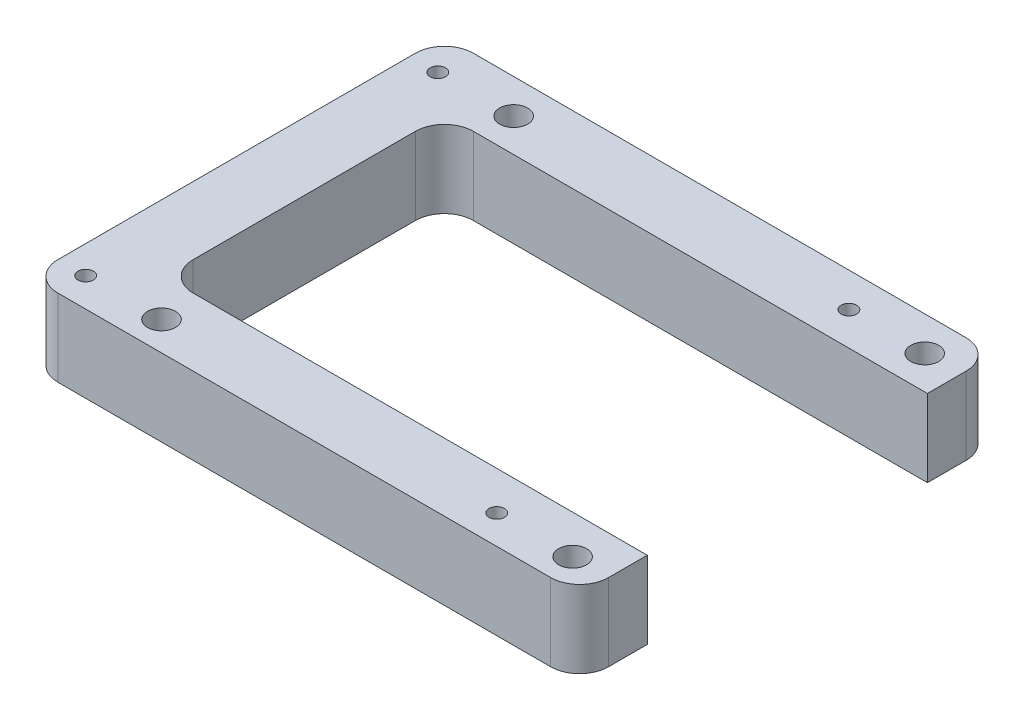
ISO-10303-21;
HEADER;
FILE_DESCRIPTION(('STEP AP214'),'2;1');
FILE_NAME('part.step','',(''),(''),'','','');
FILE_SCHEMA(('AUTOMOTIVE_DESIGN { 1 0 10303 214 1 1 1 1 }'));
ENDSEC;
DATA;
#1=APPLICATION_CONTEXT('core data for automotive mechanical design processes');
#2=APPLICATION_PROTOCOL_DEFINITION('international standard','automotive_design',2000,#1);
#3=PRODUCT_CONTEXT('',#1,'mechanical');
#4=PRODUCT('Part','Part','',(#3));
#5=PRODUCT_RELATED_PRODUCT_CATEGORY('part','',(#4));
#6=PRODUCT_DEFINITION_FORMATION('','',#4);
#7=PRODUCT_DEFINITION_CONTEXT('part definition',#1,'design');
#8=PRODUCT_DEFINITION('design','',#6,#7);
#9=PRODUCT_DEFINITION_SHAPE('','',#8);
#10=(LENGTH_UNIT() NAMED_UNIT(*) SI_UNIT(.MILLI.,.METRE.));
#11=(NAMED_UNIT(*) PLANE_ANGLE_UNIT() SI_UNIT($,.RADIAN.));
#12=(NAMED_UNIT(*) SI_UNIT($,.STERADIAN.) SOLID_ANGLE_UNIT());
#13=UNCERTAINTY_MEASURE_WITH_UNIT(LENGTH_MEASURE(1.E-05),#10,'distance_accuracy_value','');
#14=(GEOMETRIC_REPRESENTATION_CONTEXT(3) GLOBAL_UNCERTAINTY_ASSIGNED_CONTEXT((#13)) GLOBAL_UNIT_ASSIGNED_CONTEXT((#10,
#11,#12)) REPRESENTATION_CONTEXT('',''));
#15=CARTESIAN_POINT('',(0.,0.,0.));
#16=DIRECTION('',(0.,0.,1.));
#17=DIRECTION('',(1.,0.,0.));
#18=AXIS2_PLACEMENT_3D('',#15,#16,#17);
#19=CARTESIAN_POINT('',(28.5,8.,-21.5));
#20=DIRECTION('',(1.,0.,0.));
#21=DIRECTION('',(0.,0.,-1.));
#22=AXIS2_PLACEMENT_3D('',#19,#20,#21);
#23=PLANE('',#22);
#24=DIRECTION('',(0.,0.,1.));
#25=VECTOR('',#24,1.);
#26=CARTESIAN_POINT('',(28.5,0.,-21.5));
#27=LINE('',#26,#25);
#28=CARTESIAN_POINT('',(28.5,0.,-18.5));
#29=VERTEX_POINT('',#28);
#30=CARTESIAN_POINT('',(28.5,0.,-14.5));
#31=VERTEX_POINT('',#30);
#32=EDGE_CURVE('E200',#29,#31,#27,.T.);
#33=ORIENTED_EDGE('',*,*,#32,.F.);
#34=DIRECTION('',(0.,-1.,0.));
#35=VECTOR('',#34,1.);
#36=CARTESIAN_POINT('',(28.5,8.,-18.5));
#37=LINE('',#36,#35);
#38=CARTESIAN_POINT('',(28.5,8.,-18.5));
#39=VERTEX_POINT('',#38);
#40=EDGE_CURVE('E148',#29,#39,#37,.F.);
#41=ORIENTED_EDGE('',*,*,#40,.T.);
#42=DIRECTION('',(0.,0.,1.));
#43=VECTOR('',#42,1.);
#44=CARTESIAN_POINT('',(28.5,8.,-21.5));
#45=LINE('',#44,#43);
#46=CARTESIAN_POINT('',(28.5,8.,-14.5));
#47=VERTEX_POINT('',#46);
#48=EDGE_CURVE('E143',#39,#47,#45,.T.);
#49=ORIENTED_EDGE('',*,*,#48,.T.);
#50=DIRECTION('',(0.,-1.,0.));
#51=VECTOR('',#50,1.);
#52=CARTESIAN_POINT('',(28.5,8.,-14.5));
#53=LINE('',#52,#51);
#54=EDGE_CURVE('E146',#47,#31,#53,.T.);
#55=ORIENTED_EDGE('',*,*,#54,.T.);
#56=EDGE_LOOP('',(#33,#41,#49,#55));
#57=FACE_BOUND('',#56,.T.);
#58=ADVANCED_FACE('F40',(#57),#23,.T.);
#59=CARTESIAN_POINT('',(28.5,8.,14.5));
#60=VERTEX_POINT('',#59);
#61=CARTESIAN_POINT('',(28.5,8.,18.5));
#62=VERTEX_POINT('',#61);
#63=EDGE_CURVE('E152',#60,#62,#45,.T.);
#64=ORIENTED_EDGE('',*,*,#63,.T.);
#65=DIRECTION('',(0.,-1.,0.));
#66=VECTOR('',#65,1.);
#67=CARTESIAN_POINT('',(28.5,0.,18.5));
#68=LINE('',#67,#66);
#69=CARTESIAN_POINT('',(28.5,0.,18.5));
#70=VERTEX_POINT('',#69);
#71=EDGE_CURVE('E244',#62,#70,#68,.T.);
#72=ORIENTED_EDGE('',*,*,#71,.T.);
#73=CARTESIAN_POINT('',(28.5,0.,14.5));
#74=VERTEX_POINT('',#73);
#75=EDGE_CURVE('E199',#74,#70,#27,.T.);
#76=ORIENTED_EDGE('',*,*,#75,.F.);
#77=DIRECTION('',(0.,-1.,0.));
#78=VECTOR('',#77,1.);
#79=CARTESIAN_POINT('',(28.5,8.,14.5));
#80=LINE('',#79,#78);
#81=EDGE_CURVE('E164',#60,#74,#80,.T.);
#82=ORIENTED_EDGE('',*,*,#81,.F.);
#83=EDGE_LOOP('',(#64,#72,#76,#82));
#84=FACE_BOUND('',#83,.T.);
#85=ADVANCED_FACE('F275',(#84),#23,.T.);
#86=CARTESIAN_POINT('',(0.,8.,0.));
#87=DIRECTION('',(0.,-1.,0.));
#88=DIRECTION('',(0.,0.,-1.));
#89=AXIS2_PLACEMENT_3D('',#86,#87,#88);
#90=PLANE('',#89);
#91=CARTESIAN_POINT('',(24.77,8.,-17.95));
#92=DIRECTION('',(0.,-1.,0.));
#93=DIRECTION('',(0.,0.,-1.));
#94=AXIS2_PLACEMENT_3D('',#91,#92,#93);
#95=CIRCLE('',#94,1.45);
#96=CARTESIAN_POINT('',(24.77,8.,-19.4));
#97=VERTEX_POINT('',#96);
#98=EDGE_CURVE('E336',#97,#97,#95,.T.);
#99=ORIENTED_EDGE('',*,*,#98,.T.);
#100=EDGE_LOOP('',(#99));
#101=FACE_BOUND('',#100,.T.);
#102=CARTESIAN_POINT('',(-17.78,8.,-17.95));
#103=DIRECTION('',(0.,-1.,0.));
#104=DIRECTION('',(0.,0.,-1.));
#105=AXIS2_PLACEMENT_3D('',#102,#103,#104);
#106=CIRCLE('',#105,1.45);
#107=CARTESIAN_POINT('',(-17.78,8.,-19.4));
#108=VERTEX_POINT('',#107);
#109=EDGE_CURVE('E340',#108,#108,#106,.T.);
#110=ORIENTED_EDGE('',*,*,#109,.T.);
#111=EDGE_LOOP('',(#110));
#112=FACE_BOUND('',#111,.T.);
#113=CARTESIAN_POINT('',(-17.78,8.,18.5));
#114=DIRECTION('',(0.,-1.,0.));
#115=DIRECTION('',(0.,0.,-1.));
#116=AXIS2_PLACEMENT_3D('',#113,#114,#115);
#117=CIRCLE('',#116,1.45);
#118=CARTESIAN_POINT('',(-17.78,8.,17.05));
#119=VERTEX_POINT('',#118);
#120=EDGE_CURVE('E344',#119,#119,#117,.T.);
#121=ORIENTED_EDGE('',*,*,#120,.T.);
#122=EDGE_LOOP('',(#121));
#123=FACE_BOUND('',#122,.T.);
#124=CARTESIAN_POINT('',(24.77,8.,18.5));
#125=DIRECTION('',(0.,-1.,0.));
#126=DIRECTION('',(0.,0.,-1.));
#127=AXIS2_PLACEMENT_3D('',#124,#125,#126);
#128=CIRCLE('',#127,1.45);
#129=CARTESIAN_POINT('',(24.77,8.,17.05));
#130=VERTEX_POINT('',#129);
#131=EDGE_CURVE('E348',#130,#130,#128,.T.);
#132=ORIENTED_EDGE('',*,*,#131,.T.);
#133=EDGE_LOOP('',(#132));
#134=FACE_BOUND('',#133,.T.);
#135=CARTESIAN_POINT('',(-25.63,8.,-17.95));
#136=DIRECTION('',(0.,-1.,0.));
#137=DIRECTION('',(0.,0.,-1.));
#138=AXIS2_PLACEMENT_3D('',#135,#136,#137);
#139=CIRCLE('',#138,0.799999999999999);
#140=CARTESIAN_POINT('',(-25.63,8.,-18.75));
#141=VERTEX_POINT('',#140);
#142=EDGE_CURVE('E352',#141,#141,#139,.T.);
#143=ORIENTED_EDGE('',*,*,#142,.T.);
#144=EDGE_LOOP('',(#143));
#145=FACE_BOUND('',#144,.T.);
#146=CARTESIAN_POINT('',(-25.63,8.,18.5));
#147=DIRECTION('',(0.,-1.,0.));
#148=DIRECTION('',(0.,0.,-1.));
#149=AXIS2_PLACEMENT_3D('',#146,#147,#148);
#150=CIRCLE('',#149,0.799999999999999);
#151=CARTESIAN_POINT('',(-25.63,8.,17.7));
#152=VERTEX_POINT('',#151);
#153=EDGE_CURVE('E356',#152,#152,#150,.T.);
#154=ORIENTED_EDGE('',*,*,#153,.T.);
#155=EDGE_LOOP('',(#154));
#156=FACE_BOUND('',#155,.T.);
#157=CARTESIAN_POINT('',(16.92,8.,18.5));
#158=DIRECTION('',(0.,-1.,0.));
#159=DIRECTION('',(0.,0.,-1.));
#160=AXIS2_PLACEMENT_3D('',#157,#158,#159);
#161=CIRCLE('',#160,0.799999999999999);
#162=CARTESIAN_POINT('',(16.92,8.,17.7));
#163=VERTEX_POINT('',#162);
#164=EDGE_CURVE('E360',#163,#163,#161,.T.);
#165=ORIENTED_EDGE('',*,*,#164,.T.);
#166=EDGE_LOOP('',(#165));
#167=FACE_BOUND('',#166,.T.);
#168=CARTESIAN_POINT('',(16.92,8.,-17.95));
#169=DIRECTION('',(0.,-1.,0.));
#170=DIRECTION('',(0.,0.,-1.));
#171=AXIS2_PLACEMENT_3D('',#168,#169,#170);
#172=CIRCLE('',#171,0.799999999999999);
#173=CARTESIAN_POINT('',(16.92,8.,-18.75));
#174=VERTEX_POINT('',#173);
#175=EDGE_CURVE('E179',#174,#174,#172,.T.);
#176=ORIENTED_EDGE('',*,*,#175,.T.);
#177=EDGE_LOOP('',(#176));
#178=FACE_BOUND('',#177,.T.);
#179=DIRECTION('',(1.,0.,0.));
#180=VECTOR('',#179,1.);
#181=CARTESIAN_POINT('',(-28.5,8.,-21.5));
#182=LINE('',#181,#180);
#183=CARTESIAN_POINT('',(-25.5,8.,-21.5));
#184=VERTEX_POINT('',#183);
#185=CARTESIAN_POINT('',(25.5,8.,-21.5));
#186=VERTEX_POINT('',#185);
#187=EDGE_CURVE('E188',#184,#186,#182,.T.);
#188=ORIENTED_EDGE('',*,*,#187,.F.);
#189=CARTESIAN_POINT('',(-25.5,8.,-18.5));
#190=DIRECTION('',(0.,-1.,0.));
#191=DIRECTION('',(0.,0.,-1.));
#192=AXIS2_PLACEMENT_3D('',#189,#190,#191);
#193=CIRCLE('',#192,3.);
#194=CARTESIAN_POINT('',(-28.5,8.,-18.5));
#195=VERTEX_POINT('',#194);
#196=EDGE_CURVE('E237',#184,#195,#193,.F.);
#197=ORIENTED_EDGE('',*,*,#196,.T.);
#198=DIRECTION('',(0.,0.,1.));
#199=VECTOR('',#198,1.);
#200=CARTESIAN_POINT('',(-28.5,8.,-21.5));
#201=LINE('',#200,#199);
#202=CARTESIAN_POINT('',(-28.5,8.,18.5));
#203=VERTEX_POINT('',#202);
#204=EDGE_CURVE('E193',#195,#203,#201,.T.);
#205=ORIENTED_EDGE('',*,*,#204,.T.);
#206=CARTESIAN_POINT('',(-25.5,8.,18.5));
#207=DIRECTION('',(0.,-1.,0.));
#208=DIRECTION('',(0.,0.,-1.));
#209=AXIS2_PLACEMENT_3D('',#206,#207,#208);
#210=CIRCLE('',#209,3.);
#211=CARTESIAN_POINT('',(-25.5,8.,21.5));
#212=VERTEX_POINT('',#211);
#213=EDGE_CURVE('E235',#203,#212,#210,.F.);
#214=ORIENTED_EDGE('',*,*,#213,.T.);
#215=DIRECTION('',(1.,0.,0.));
#216=VECTOR('',#215,1.);
#217=CARTESIAN_POINT('',(-28.5,8.,21.5));
#218=LINE('',#217,#216);
#219=CARTESIAN_POINT('',(25.5,8.,21.5));
#220=VERTEX_POINT('',#219);
#221=EDGE_CURVE('E151',#212,#220,#218,.T.);
#222=ORIENTED_EDGE('',*,*,#221,.T.);
#223=CARTESIAN_POINT('',(25.5,8.,18.5));
#224=DIRECTION('',(0.,-1.,0.));
#225=DIRECTION('',(0.,0.,-1.));
#226=AXIS2_PLACEMENT_3D('',#223,#224,#225);
#227=CIRCLE('',#226,3.);
#228=EDGE_CURVE('E55',#220,#62,#227,.F.);
#229=ORIENTED_EDGE('',*,*,#228,.T.);
#230=ORIENTED_EDGE('',*,*,#63,.F.);
#231=DIRECTION('',(1.,0.,0.));
#232=VECTOR('',#231,1.);
#233=CARTESIAN_POINT('',(28.5,8.,14.5));
#234=LINE('',#233,#232);
#235=CARTESIAN_POINT('',(-18.5,8.,14.5));
#236=VERTEX_POINT('',#235);
#237=EDGE_CURVE('E174',#236,#60,#234,.T.);
#238=ORIENTED_EDGE('',*,*,#237,.F.);
#239=CARTESIAN_POINT('',(-18.5,8.,11.5));
#240=DIRECTION('',(0.,-1.,0.));
#241=DIRECTION('',(0.,0.,-1.));
#242=AXIS2_PLACEMENT_3D('',#239,#240,#241);
#243=CIRCLE('',#242,3.);
#244=CARTESIAN_POINT('',(-21.5,8.,11.5));
#245=VERTEX_POINT('',#244);
#246=EDGE_CURVE('E249',#236,#245,#243,.T.);
#247=ORIENTED_EDGE('',*,*,#246,.T.);
#248=DIRECTION('',(0.,0.,1.));
#249=VECTOR('',#248,1.);
#250=CARTESIAN_POINT('',(-21.5,8.,14.5));
#251=LINE('',#250,#249);
#252=CARTESIAN_POINT('',(-21.5,8.,-11.5));
#253=VERTEX_POINT('',#252);
#254=EDGE_CURVE('E170',#253,#245,#251,.T.);
#255=ORIENTED_EDGE('',*,*,#254,.F.);
#256=CARTESIAN_POINT('',(-18.5,8.,-11.5));
#257=DIRECTION('',(0.,-1.,0.));
#258=DIRECTION('',(0.,0.,-1.));
#259=AXIS2_PLACEMENT_3D('',#256,#257,#258);
#260=CIRCLE('',#259,3.);
#261=CARTESIAN_POINT('',(-18.5,8.,-14.5));
#262=VERTEX_POINT('',#261);
#263=EDGE_CURVE('E11',#253,#262,#260,.T.);
#264=ORIENTED_EDGE('',*,*,#263,.T.);
#265=DIRECTION('',(-1.,0.,0.));
#266=VECTOR('',#265,1.);
#267=CARTESIAN_POINT('',(28.5,8.,-14.5));
#268=LINE('',#267,#266);
#269=EDGE_CURVE('E159',#47,#262,#268,.T.);
#270=ORIENTED_EDGE('',*,*,#269,.F.);
#271=ORIENTED_EDGE('',*,*,#48,.F.);
#272=CARTESIAN_POINT('',(25.5,8.,-18.5));
#273=DIRECTION('',(0.,-1.,0.));
#274=DIRECTION('',(0.,0.,-1.));
#275=AXIS2_PLACEMENT_3D('',#272,#273,#274);
#276=CIRCLE('',#275,3.);
#277=EDGE_CURVE('E233',#39,#186,#276,.F.);
#278=ORIENTED_EDGE('',*,*,#277,.T.);
#279=EDGE_LOOP('',(#188,#197,#205,#214,#222,#229,#230,#238,#247,#255,#264,#270,#271,#278));
#280=FACE_BOUND('',#279,.T.);
#281=ADVANCED_FACE('F167',(#101,#112,#123,#134,#145,#156,#167,#178,#280),#90,.F.);
#282=CARTESIAN_POINT('',(0.,0.,0.));
#283=DIRECTION('',(0.,-1.,0.));
#284=DIRECTION('',(0.,0.,-1.));
#285=AXIS2_PLACEMENT_3D('',#282,#283,#284);
#286=PLANE('',#285);
#287=CARTESIAN_POINT('',(24.77,0.,-17.95));
#288=DIRECTION('',(0.,-1.,0.));
#289=DIRECTION('',(0.,0.,-1.));
#290=AXIS2_PLACEMENT_3D('',#287,#288,#289);
#291=CIRCLE('',#290,2.45);
#292=CARTESIAN_POINT('',(24.77,0.,-20.4));
#293=VERTEX_POINT('',#292);
#294=EDGE_CURVE('E418',#293,#293,#291,.T.);
#295=ORIENTED_EDGE('',*,*,#294,.F.);
#296=EDGE_LOOP('',(#295));
#297=FACE_BOUND('',#296,.T.);
#298=CARTESIAN_POINT('',(-17.78,0.,-17.95));
#299=DIRECTION('',(0.,-1.,0.));
#300=DIRECTION('',(0.,0.,-1.));
#301=AXIS2_PLACEMENT_3D('',#298,#299,#300);
#302=CIRCLE('',#301,2.45);
#303=CARTESIAN_POINT('',(-17.78,0.,-20.4));
#304=VERTEX_POINT('',#303);
#305=EDGE_CURVE('E408',#304,#304,#302,.T.);
#306=ORIENTED_EDGE('',*,*,#305,.F.);
#307=EDGE_LOOP('',(#306));
#308=FACE_BOUND('',#307,.T.);
#309=CARTESIAN_POINT('',(-17.78,0.,18.5));
#310=DIRECTION('',(0.,-1.,0.));
#311=DIRECTION('',(0.,0.,-1.));
#312=AXIS2_PLACEMENT_3D('',#309,#310,#311);
#313=CIRCLE('',#312,2.45);
#314=CARTESIAN_POINT('',(-17.78,0.,16.05));
#315=VERTEX_POINT('',#314);
#316=EDGE_CURVE('E398',#315,#315,#313,.T.);
#317=ORIENTED_EDGE('',*,*,#316,.F.);
#318=EDGE_LOOP('',(#317));
#319=FACE_BOUND('',#318,.T.);
#320=CARTESIAN_POINT('',(24.77,0.,18.5));
#321=DIRECTION('',(0.,-1.,0.));
#322=DIRECTION('',(0.,0.,-1.));
#323=AXIS2_PLACEMENT_3D('',#320,#321,#322);
#324=CIRCLE('',#323,2.45);
#325=CARTESIAN_POINT('',(24.77,0.,16.05));
#326=VERTEX_POINT('',#325);
#327=EDGE_CURVE('E388',#326,#326,#324,.T.);
#328=ORIENTED_EDGE('',*,*,#327,.F.);
#329=EDGE_LOOP('',(#328));
#330=FACE_BOUND('',#329,.T.);
#331=CARTESIAN_POINT('',(-25.63,0.,-17.95));
#332=DIRECTION('',(0.,-1.,0.));
#333=DIRECTION('',(0.,0.,-1.));
#334=AXIS2_PLACEMENT_3D('',#331,#332,#333);
#335=CIRCLE('',#334,0.799999999999999);
#336=CARTESIAN_POINT('',(-25.63,0.,-18.75));
#337=VERTEX_POINT('',#336);
#338=EDGE_CURVE('E378',#337,#337,#335,.T.);
#339=ORIENTED_EDGE('',*,*,#338,.F.);
#340=EDGE_LOOP('',(#339));
#341=FACE_BOUND('',#340,.T.);
#342=CARTESIAN_POINT('',(-25.63,0.,18.5));
#343=DIRECTION('',(0.,-1.,0.));
#344=DIRECTION('',(0.,0.,-1.));
#345=AXIS2_PLACEMENT_3D('',#342,#343,#344);
#346=CIRCLE('',#345,0.799999999999999);
#347=CARTESIAN_POINT('',(-25.63,0.,17.7));
#348=VERTEX_POINT('',#347);
#349=EDGE_CURVE('E374',#348,#348,#346,.T.);
#350=ORIENTED_EDGE('',*,*,#349,.F.);
#351=EDGE_LOOP('',(#350));
#352=FACE_BOUND('',#351,.T.);
#353=CARTESIAN_POINT('',(16.92,0.,18.5));
#354=DIRECTION('',(0.,-1.,0.));
#355=DIRECTION('',(0.,0.,-1.));
#356=AXIS2_PLACEMENT_3D('',#353,#354,#355);
#357=CIRCLE('',#356,0.799999999999999);
#358=CARTESIAN_POINT('',(16.92,0.,17.7));
#359=VERTEX_POINT('',#358);
#360=EDGE_CURVE('E368',#359,#359,#357,.T.);
#361=ORIENTED_EDGE('',*,*,#360,.F.);
#362=EDGE_LOOP('',(#361));
#363=FACE_BOUND('',#362,.T.);
#364=CARTESIAN_POINT('',(16.92,0.,-17.95));
#365=DIRECTION('',(0.,-1.,0.));
#366=DIRECTION('',(0.,0.,-1.));
#367=AXIS2_PLACEMENT_3D('',#364,#365,#366);
#368=CIRCLE('',#367,0.799999999999999);
#369=CARTESIAN_POINT('',(16.92,0.,-18.75));
#370=VERTEX_POINT('',#369);
#371=EDGE_CURVE('E364',#370,#370,#368,.T.);
#372=ORIENTED_EDGE('',*,*,#371,.F.);
#373=EDGE_LOOP('',(#372));
#374=FACE_BOUND('',#373,.T.);
#375=DIRECTION('',(0.,0.,1.));
#376=VECTOR('',#375,1.);
#377=CARTESIAN_POINT('',(-28.5,0.,-21.5));
#378=LINE('',#377,#376);
#379=CARTESIAN_POINT('',(-28.5,0.,-18.5));
#380=VERTEX_POINT('',#379);
#381=CARTESIAN_POINT('',(-28.5,0.,18.5));
#382=VERTEX_POINT('',#381);
#383=EDGE_CURVE('E190',#380,#382,#378,.T.);
#384=ORIENTED_EDGE('',*,*,#383,.F.);
#385=CARTESIAN_POINT('',(-25.5,0.,-18.5));
#386=DIRECTION('',(0.,-1.,0.));
#387=DIRECTION('',(0.,0.,-1.));
#388=AXIS2_PLACEMENT_3D('',#385,#386,#387);
#389=CIRCLE('',#388,3.);
#390=CARTESIAN_POINT('',(-25.5,0.,-21.5));
#391=VERTEX_POINT('',#390);
#392=EDGE_CURVE('E225',#380,#391,#389,.T.);
#393=ORIENTED_EDGE('',*,*,#392,.T.);
#394=DIRECTION('',(1.,0.,0.));
#395=VECTOR('',#394,1.);
#396=CARTESIAN_POINT('',(-28.5,0.,-21.5));
#397=LINE('',#396,#395);
#398=CARTESIAN_POINT('',(25.5,0.,-21.5));
#399=VERTEX_POINT('',#398);
#400=EDGE_CURVE('E163',#391,#399,#397,.T.);
#401=ORIENTED_EDGE('',*,*,#400,.T.);
#402=CARTESIAN_POINT('',(25.5,0.,-18.5));
#403=DIRECTION('',(0.,-1.,0.));
#404=DIRECTION('',(0.,0.,-1.));
#405=AXIS2_PLACEMENT_3D('',#402,#403,#404);
#406=CIRCLE('',#405,3.);
#407=EDGE_CURVE('E221',#399,#29,#406,.T.);
#408=ORIENTED_EDGE('',*,*,#407,.T.);
#409=ORIENTED_EDGE('',*,*,#32,.T.);
#410=DIRECTION('',(-1.,0.,0.));
#411=VECTOR('',#410,1.);
#412=CARTESIAN_POINT('',(28.5,0.,-14.5));
#413=LINE('',#412,#411);
#414=CARTESIAN_POINT('',(-18.5,0.,-14.5));
#415=VERTEX_POINT('',#414);
#416=EDGE_CURVE('E162',#31,#415,#413,.T.);
#417=ORIENTED_EDGE('',*,*,#416,.T.);
#418=CARTESIAN_POINT('',(-18.5,0.,-11.5));
#419=DIRECTION('',(0.,-1.,0.));
#420=DIRECTION('',(0.,0.,-1.));
#421=AXIS2_PLACEMENT_3D('',#418,#419,#420);
#422=CIRCLE('',#421,3.);
#423=CARTESIAN_POINT('',(-21.5,0.,-11.5));
#424=VERTEX_POINT('',#423);
#425=EDGE_CURVE('E48',#415,#424,#422,.F.);
#426=ORIENTED_EDGE('',*,*,#425,.T.);
#427=DIRECTION('',(0.,0.,1.));
#428=VECTOR('',#427,1.);
#429=CARTESIAN_POINT('',(-21.5,0.,14.5));
#430=LINE('',#429,#428);
#431=CARTESIAN_POINT('',(-21.5,0.,11.5));
#432=VERTEX_POINT('',#431);
#433=EDGE_CURVE('E176',#424,#432,#430,.T.);
#434=ORIENTED_EDGE('',*,*,#433,.T.);
#435=CARTESIAN_POINT('',(-18.5,0.,11.5));
#436=DIRECTION('',(0.,-1.,0.));
#437=DIRECTION('',(0.,0.,-1.));
#438=AXIS2_PLACEMENT_3D('',#435,#436,#437);
#439=CIRCLE('',#438,3.);
#440=CARTESIAN_POINT('',(-18.5,0.,14.5));
#441=VERTEX_POINT('',#440);
#442=EDGE_CURVE('E247',#432,#441,#439,.F.);
#443=ORIENTED_EDGE('',*,*,#442,.T.);
#444=DIRECTION('',(1.,0.,0.));
#445=VECTOR('',#444,1.);
#446=CARTESIAN_POINT('',(28.5,0.,14.5));
#447=LINE('',#446,#445);
#448=EDGE_CURVE('E171',#441,#74,#447,.T.);
#449=ORIENTED_EDGE('',*,*,#448,.T.);
#450=ORIENTED_EDGE('',*,*,#75,.T.);
#451=CARTESIAN_POINT('',(25.5,0.,18.5));
#452=DIRECTION('',(0.,-1.,0.));
#453=DIRECTION('',(0.,0.,-1.));
#454=AXIS2_PLACEMENT_3D('',#451,#452,#453);
#455=CIRCLE('',#454,3.);
#456=CARTESIAN_POINT('',(25.5,0.,21.5));
#457=VERTEX_POINT('',#456);
#458=EDGE_CURVE('E219',#70,#457,#455,.T.);
#459=ORIENTED_EDGE('',*,*,#458,.T.);
#460=DIRECTION('',(1.,0.,0.));
#461=VECTOR('',#460,1.);
#462=CARTESIAN_POINT('',(-28.5,0.,21.5));
#463=LINE('',#462,#461);
#464=CARTESIAN_POINT('',(-25.5,0.,21.5));
#465=VERTEX_POINT('',#464);
#466=EDGE_CURVE('E202',#465,#457,#463,.T.);
#467=ORIENTED_EDGE('',*,*,#466,.F.);
#468=CARTESIAN_POINT('',(-25.5,0.,18.5));
#469=DIRECTION('',(0.,-1.,0.));
#470=DIRECTION('',(0.,0.,-1.));
#471=AXIS2_PLACEMENT_3D('',#468,#469,#470);
#472=CIRCLE('',#471,3.);
#473=EDGE_CURVE('E223',#465,#382,#472,.T.);
#474=ORIENTED_EDGE('',*,*,#473,.T.);
#475=EDGE_LOOP('',(#384,#393,#401,#408,#409,#417,#426,#434,#443,#449,#450,#459,#467,#474));
#476=FACE_BOUND('',#475,.T.);
#477=ADVANCED_FACE('F253',(#297,#308,#319,#330,#341,#352,#363,#374,#476),#286,.T.);
#478=CARTESIAN_POINT('',(-28.5,8.,-21.5));
#479=DIRECTION('',(0.,0.,-1.));
#480=DIRECTION('',(-1.,0.,0.));
#481=AXIS2_PLACEMENT_3D('',#478,#479,#480);
#482=PLANE('',#481);
#483=ORIENTED_EDGE('',*,*,#400,.F.);
#484=DIRECTION('',(0.,-1.,0.));
#485=VECTOR('',#484,1.);
#486=CARTESIAN_POINT('',(-25.5,8.,-21.5));
#487=LINE('',#486,#485);
#488=EDGE_CURVE('E230',#391,#184,#487,.F.);
#489=ORIENTED_EDGE('',*,*,#488,.T.);
#490=ORIENTED_EDGE('',*,*,#187,.T.);
#491=DIRECTION('',(0.,-1.,0.));
#492=VECTOR('',#491,1.);
#493=CARTESIAN_POINT('',(25.5,8.,-21.5));
#494=LINE('',#493,#492);
#495=EDGE_CURVE('E227',#186,#399,#494,.T.);
#496=ORIENTED_EDGE('',*,*,#495,.T.);
#497=EDGE_LOOP('',(#483,#489,#490,#496));
#498=FACE_BOUND('',#497,.T.);
#499=ADVANCED_FACE('F285',(#498),#482,.T.);
#500=CARTESIAN_POINT('',(-28.5,8.,-21.5));
#501=DIRECTION('',(1.,0.,0.));
#502=DIRECTION('',(0.,0.,-1.));
#503=AXIS2_PLACEMENT_3D('',#500,#501,#502);
#504=PLANE('',#503);
#505=ORIENTED_EDGE('',*,*,#204,.F.);
#506=DIRECTION('',(0.,-1.,0.));
#507=VECTOR('',#506,1.);
#508=CARTESIAN_POINT('',(-28.5,0.,-18.5));
#509=LINE('',#508,#507);
#510=EDGE_CURVE('E216',#195,#380,#509,.T.);
#511=ORIENTED_EDGE('',*,*,#510,.T.);
#512=ORIENTED_EDGE('',*,*,#383,.T.);
#513=DIRECTION('',(0.,-1.,0.));
#514=VECTOR('',#513,1.);
#515=CARTESIAN_POINT('',(-28.5,8.,18.5));
#516=LINE('',#515,#514);
#517=EDGE_CURVE('E214',#382,#203,#516,.F.);
#518=ORIENTED_EDGE('',*,*,#517,.T.);
#519=EDGE_LOOP('',(#505,#511,#512,#518));
#520=FACE_BOUND('',#519,.T.);
#521=ADVANCED_FACE('F287',(#520),#504,.F.);
#522=CARTESIAN_POINT('',(-28.5,8.,21.5));
#523=DIRECTION('',(0.,0.,-1.));
#524=DIRECTION('',(-1.,0.,0.));
#525=AXIS2_PLACEMENT_3D('',#522,#523,#524);
#526=PLANE('',#525);
#527=ORIENTED_EDGE('',*,*,#221,.F.);
#528=DIRECTION('',(0.,-1.,0.));
#529=VECTOR('',#528,1.);
#530=CARTESIAN_POINT('',(-25.5,8.,21.5));
#531=LINE('',#530,#529);
#532=EDGE_CURVE('E240',#212,#465,#531,.T.);
#533=ORIENTED_EDGE('',*,*,#532,.T.);
#534=ORIENTED_EDGE('',*,*,#466,.T.);
#535=DIRECTION('',(0.,-1.,0.));
#536=VECTOR('',#535,1.);
#537=CARTESIAN_POINT('',(25.5,8.,21.5));
#538=LINE('',#537,#536);
#539=EDGE_CURVE('E63',#457,#220,#538,.F.);
#540=ORIENTED_EDGE('',*,*,#539,.T.);
#541=EDGE_LOOP('',(#527,#533,#534,#540));
#542=FACE_BOUND('',#541,.T.);
#543=ADVANCED_FACE('F283',(#542),#526,.F.);
#544=CARTESIAN_POINT('',(28.5,8.,-14.5));
#545=DIRECTION('',(0.,0.,1.));
#546=DIRECTION('',(1.,0.,0.));
#547=AXIS2_PLACEMENT_3D('',#544,#545,#546);
#548=PLANE('',#547);
#549=ORIENTED_EDGE('',*,*,#269,.T.);
#550=DIRECTION('',(0.,-1.,0.));
#551=VECTOR('',#550,1.);
#552=CARTESIAN_POINT('',(-18.5,0.,-14.5));
#553=LINE('',#552,#551);
#554=EDGE_CURVE('E212',#262,#415,#553,.T.);
#555=ORIENTED_EDGE('',*,*,#554,.T.);
#556=ORIENTED_EDGE('',*,*,#416,.F.);
#557=ORIENTED_EDGE('',*,*,#54,.F.);
#558=EDGE_LOOP('',(#549,#555,#556,#557));
#559=FACE_BOUND('',#558,.T.);
#560=ADVANCED_FACE('F157',(#559),#548,.T.);
#561=CARTESIAN_POINT('',(-21.5,8.,14.5));
#562=DIRECTION('',(1.,0.,0.));
#563=DIRECTION('',(0.,0.,-1.));
#564=AXIS2_PLACEMENT_3D('',#561,#562,#563);
#565=PLANE('',#564);
#566=ORIENTED_EDGE('',*,*,#254,.T.);
#567=DIRECTION('',(0.,-1.,0.));
#568=VECTOR('',#567,1.);
#569=CARTESIAN_POINT('',(-21.5,0.,11.5));
#570=LINE('',#569,#568);
#571=EDGE_CURVE('E207',#245,#432,#570,.T.);
#572=ORIENTED_EDGE('',*,*,#571,.T.);
#573=ORIENTED_EDGE('',*,*,#433,.F.);
#574=DIRECTION('',(0.,-1.,0.));
#575=VECTOR('',#574,1.);
#576=CARTESIAN_POINT('',(-21.5,8.,-11.5));
#577=LINE('',#576,#575);
#578=EDGE_CURVE('E196',#424,#253,#577,.F.);
#579=ORIENTED_EDGE('',*,*,#578,.T.);
#580=EDGE_LOOP('',(#566,#572,#573,#579));
#581=FACE_BOUND('',#580,.T.);
#582=ADVANCED_FACE('F257',(#581),#565,.T.);
#583=CARTESIAN_POINT('',(28.5,8.,14.5));
#584=DIRECTION('',(0.,0.,-1.));
#585=DIRECTION('',(-1.,0.,0.));
#586=AXIS2_PLACEMENT_3D('',#583,#584,#585);
#587=PLANE('',#586);
#588=ORIENTED_EDGE('',*,*,#448,.F.);
#589=DIRECTION('',(0.,-1.,0.));
#590=VECTOR('',#589,1.);
#591=CARTESIAN_POINT('',(-18.5,8.,14.5));
#592=LINE('',#591,#590);
#593=EDGE_CURVE('E210',#441,#236,#592,.F.);
#594=ORIENTED_EDGE('',*,*,#593,.T.);
#595=ORIENTED_EDGE('',*,*,#237,.T.);
#596=ORIENTED_EDGE('',*,*,#81,.T.);
#597=EDGE_LOOP('',(#588,#594,#595,#596));
#598=FACE_BOUND('',#597,.T.);
#599=ADVANCED_FACE('F271',(#598),#587,.T.);
#600=CARTESIAN_POINT('',(-18.5,8.,11.5));
#601=DIRECTION('',(0.,1.,0.));
#602=DIRECTION('',(0.,0.,1.));
#603=AXIS2_PLACEMENT_3D('',#600,#601,#602);
#604=CYLINDRICAL_SURFACE('',#603,3.);
#605=ORIENTED_EDGE('',*,*,#246,.F.);
#606=ORIENTED_EDGE('',*,*,#593,.F.);
#607=ORIENTED_EDGE('',*,*,#442,.F.);
#608=ORIENTED_EDGE('',*,*,#571,.F.);
#609=EDGE_LOOP('',(#605,#606,#607,#608));
#610=FACE_BOUND('',#609,.T.);
#611=ADVANCED_FACE('F262',(#610),#604,.F.);
#612=CARTESIAN_POINT('',(-18.5,8.,-11.5));
#613=DIRECTION('',(0.,1.,0.));
#614=DIRECTION('',(0.,0.,1.));
#615=AXIS2_PLACEMENT_3D('',#612,#613,#614);
#616=CYLINDRICAL_SURFACE('',#615,3.);
#617=ORIENTED_EDGE('',*,*,#263,.F.);
#618=ORIENTED_EDGE('',*,*,#578,.F.);
#619=ORIENTED_EDGE('',*,*,#425,.F.);
#620=ORIENTED_EDGE('',*,*,#554,.F.);
#621=EDGE_LOOP('',(#617,#618,#619,#620));
#622=FACE_BOUND('',#621,.T.);
#623=ADVANCED_FACE('F259',(#622),#616,.F.);
#624=CARTESIAN_POINT('',(-25.5,8.,-18.5));
#625=DIRECTION('',(0.,1.,0.));
#626=DIRECTION('',(0.,0.,1.));
#627=AXIS2_PLACEMENT_3D('',#624,#625,#626);
#628=CYLINDRICAL_SURFACE('',#627,3.);
#629=ORIENTED_EDGE('',*,*,#196,.F.);
#630=ORIENTED_EDGE('',*,*,#488,.F.);
#631=ORIENTED_EDGE('',*,*,#392,.F.);
#632=ORIENTED_EDGE('',*,*,#510,.F.);
#633=EDGE_LOOP('',(#629,#630,#631,#632));
#634=FACE_BOUND('',#633,.T.);
#635=ADVANCED_FACE('F261',(#634),#628,.T.);
#636=CARTESIAN_POINT('',(-25.5,8.,18.5));
#637=DIRECTION('',(0.,-1.,0.));
#638=DIRECTION('',(0.,0.,-1.));
#639=AXIS2_PLACEMENT_3D('',#636,#637,#638);
#640=CYLINDRICAL_SURFACE('',#639,3.);
#641=ORIENTED_EDGE('',*,*,#213,.F.);
#642=ORIENTED_EDGE('',*,*,#517,.F.);
#643=ORIENTED_EDGE('',*,*,#473,.F.);
#644=ORIENTED_EDGE('',*,*,#532,.F.);
#645=EDGE_LOOP('',(#641,#642,#643,#644));
#646=FACE_BOUND('',#645,.T.);
#647=ADVANCED_FACE('F268',(#646),#640,.T.);
#648=CARTESIAN_POINT('',(25.5,8.,-18.5));
#649=DIRECTION('',(0.,-1.,0.));
#650=DIRECTION('',(0.,0.,-1.));
#651=AXIS2_PLACEMENT_3D('',#648,#649,#650);
#652=CYLINDRICAL_SURFACE('',#651,3.);
#653=ORIENTED_EDGE('',*,*,#277,.F.);
#654=ORIENTED_EDGE('',*,*,#40,.F.);
#655=ORIENTED_EDGE('',*,*,#407,.F.);
#656=ORIENTED_EDGE('',*,*,#495,.F.);
#657=EDGE_LOOP('',(#653,#654,#655,#656));
#658=FACE_BOUND('',#657,.T.);
#659=ADVANCED_FACE('F601',(#658),#652,.T.);
#660=CARTESIAN_POINT('',(25.5,8.,18.5));
#661=DIRECTION('',(0.,1.,0.));
#662=DIRECTION('',(0.,0.,1.));
#663=AXIS2_PLACEMENT_3D('',#660,#661,#662);
#664=CYLINDRICAL_SURFACE('',#663,3.);
#665=ORIENTED_EDGE('',*,*,#228,.F.);
#666=ORIENTED_EDGE('',*,*,#539,.F.);
#667=ORIENTED_EDGE('',*,*,#458,.F.);
#668=ORIENTED_EDGE('',*,*,#71,.F.);
#669=EDGE_LOOP('',(#665,#666,#667,#668));
#670=FACE_BOUND('',#669,.T.);
#671=ADVANCED_FACE('F42',(#670),#664,.T.);
#672=CARTESIAN_POINT('',(16.92,0.,-17.95));
#673=DIRECTION('',(0.,-1.,0.));
#674=DIRECTION('',(0.,0.,-1.));
#675=AXIS2_PLACEMENT_3D('',#672,#673,#674);
#676=CYLINDRICAL_SURFACE('',#675,0.799999999999999);
#677=ORIENTED_EDGE('',*,*,#175,.F.);
#678=EDGE_LOOP('',(#677));
#679=FACE_BOUND('',#678,.T.);
#680=ORIENTED_EDGE('',*,*,#371,.T.);
#681=EDGE_LOOP('',(#680));
#682=FACE_BOUND('',#681,.T.);
#683=ADVANCED_FACE('F324',(#679,#682),#676,.F.);
#684=CARTESIAN_POINT('',(16.92,0.,18.5));
#685=DIRECTION('',(0.,-1.,0.));
#686=DIRECTION('',(0.,0.,-1.));
#687=AXIS2_PLACEMENT_3D('',#684,#685,#686);
#688=CYLINDRICAL_SURFACE('',#687,0.799999999999999);
#689=ORIENTED_EDGE('',*,*,#164,.F.);
#690=EDGE_LOOP('',(#689));
#691=FACE_BOUND('',#690,.T.);
#692=ORIENTED_EDGE('',*,*,#360,.T.);
#693=EDGE_LOOP('',(#692));
#694=FACE_BOUND('',#693,.T.);
#695=ADVANCED_FACE('F437',(#691,#694),#688,.F.);
#696=CARTESIAN_POINT('',(-25.63,0.,18.5));
#697=DIRECTION('',(0.,-1.,0.));
#698=DIRECTION('',(0.,0.,-1.));
#699=AXIS2_PLACEMENT_3D('',#696,#697,#698);
#700=CYLINDRICAL_SURFACE('',#699,0.799999999999999);
#701=ORIENTED_EDGE('',*,*,#153,.F.);
#702=EDGE_LOOP('',(#701));
#703=FACE_BOUND('',#702,.T.);
#704=ORIENTED_EDGE('',*,*,#349,.T.);
#705=EDGE_LOOP('',(#704));
#706=FACE_BOUND('',#705,.T.);
#707=ADVANCED_FACE('F439',(#703,#706),#700,.F.);
#708=CARTESIAN_POINT('',(-25.63,0.,-17.95));
#709=DIRECTION('',(0.,-1.,0.));
#710=DIRECTION('',(0.,0.,-1.));
#711=AXIS2_PLACEMENT_3D('',#708,#709,#710);
#712=CYLINDRICAL_SURFACE('',#711,0.799999999999999);
#713=ORIENTED_EDGE('',*,*,#142,.F.);
#714=EDGE_LOOP('',(#713));
#715=FACE_BOUND('',#714,.T.);
#716=ORIENTED_EDGE('',*,*,#338,.T.);
#717=EDGE_LOOP('',(#716));
#718=FACE_BOUND('',#717,.T.);
#719=ADVANCED_FACE('F445',(#715,#718),#712,.F.);
#720=CARTESIAN_POINT('',(24.77,0.,18.5));
#721=DIRECTION('',(0.,-1.,0.));
#722=DIRECTION('',(0.,0.,-1.));
#723=AXIS2_PLACEMENT_3D('',#720,#721,#722);
#724=CYLINDRICAL_SURFACE('',#723,1.45);
#725=ORIENTED_EDGE('',*,*,#131,.F.);
#726=EDGE_LOOP('',(#725));
#727=FACE_BOUND('',#726,.T.);
#728=CARTESIAN_POINT('',(24.77,5.5,18.5));
#729=DIRECTION('',(0.,-1.,0.));
#730=DIRECTION('',(0.,0.,-1.));
#731=AXIS2_PLACEMENT_3D('',#728,#729,#730);
#732=CIRCLE('',#731,1.45);
#733=CARTESIAN_POINT('',(24.77,5.5,17.05));
#734=VERTEX_POINT('',#733);
#735=EDGE_CURVE('E382',#734,#734,#732,.T.);
#736=ORIENTED_EDGE('',*,*,#735,.T.);
#737=EDGE_LOOP('',(#736));
#738=FACE_BOUND('',#737,.T.);
#739=ADVANCED_FACE('F451',(#727,#738),#724,.F.);
#740=CARTESIAN_POINT('',(26.22,5.5,18.5));
#741=DIRECTION('',(0.,1.,0.));
#742=DIRECTION('',(0.,0.,1.));
#743=AXIS2_PLACEMENT_3D('',#740,#741,#742);
#744=PLANE('',#743);
#745=ORIENTED_EDGE('',*,*,#735,.F.);
#746=EDGE_LOOP('',(#745));
#747=FACE_BOUND('',#746,.T.);
#748=CARTESIAN_POINT('',(24.77,5.5,18.5));
#749=DIRECTION('',(0.,-1.,0.));
#750=DIRECTION('',(0.,0.,-1.));
#751=AXIS2_PLACEMENT_3D('',#748,#749,#750);
#752=CIRCLE('',#751,2.45);
#753=CARTESIAN_POINT('',(24.77,5.5,16.05));
#754=VERTEX_POINT('',#753);
#755=EDGE_CURVE('E385',#754,#754,#752,.T.);
#756=ORIENTED_EDGE('',*,*,#755,.T.);
#757=EDGE_LOOP('',(#756));
#758=FACE_BOUND('',#757,.T.);
#759=ADVANCED_FACE('F455',(#747,#758),#744,.F.);
#760=CARTESIAN_POINT('',(24.77,0.,18.5));
#761=DIRECTION('',(0.,-1.,0.));
#762=DIRECTION('',(0.,0.,-1.));
#763=AXIS2_PLACEMENT_3D('',#760,#761,#762);
#764=CYLINDRICAL_SURFACE('',#763,2.45);
#765=ORIENTED_EDGE('',*,*,#755,.F.);
#766=EDGE_LOOP('',(#765));
#767=FACE_BOUND('',#766,.T.);
#768=ORIENTED_EDGE('',*,*,#327,.T.);
#769=EDGE_LOOP('',(#768));
#770=FACE_BOUND('',#769,.T.);
#771=ADVANCED_FACE('F459',(#767,#770),#764,.F.);
#772=CARTESIAN_POINT('',(-17.78,0.,18.5));
#773=DIRECTION('',(0.,-1.,0.));
#774=DIRECTION('',(0.,0.,-1.));
#775=AXIS2_PLACEMENT_3D('',#772,#773,#774);
#776=CYLINDRICAL_SURFACE('',#775,1.45);
#777=ORIENTED_EDGE('',*,*,#120,.F.);
#778=EDGE_LOOP('',(#777));
#779=FACE_BOUND('',#778,.T.);
#780=CARTESIAN_POINT('',(-17.78,5.5,18.5));
#781=DIRECTION('',(0.,-1.,0.));
#782=DIRECTION('',(0.,0.,-1.));
#783=AXIS2_PLACEMENT_3D('',#780,#781,#782);
#784=CIRCLE('',#783,1.45);
#785=CARTESIAN_POINT('',(-17.78,5.5,17.05));
#786=VERTEX_POINT('',#785);
#787=EDGE_CURVE('E392',#786,#786,#784,.T.);
#788=ORIENTED_EDGE('',*,*,#787,.T.);
#789=EDGE_LOOP('',(#788));
#790=FACE_BOUND('',#789,.T.);
#791=ADVANCED_FACE('F463',(#779,#790),#776,.F.);
#792=CARTESIAN_POINT('',(-16.33,5.5,18.5));
#793=DIRECTION('',(0.,1.,0.));
#794=DIRECTION('',(0.,0.,1.));
#795=AXIS2_PLACEMENT_3D('',#792,#793,#794);
#796=PLANE('',#795);
#797=ORIENTED_EDGE('',*,*,#787,.F.);
#798=EDGE_LOOP('',(#797));
#799=FACE_BOUND('',#798,.T.);
#800=CARTESIAN_POINT('',(-17.78,5.5,18.5));
#801=DIRECTION('',(0.,-1.,0.));
#802=DIRECTION('',(0.,0.,-1.));
#803=AXIS2_PLACEMENT_3D('',#800,#801,#802);
#804=CIRCLE('',#803,2.45);
#805=CARTESIAN_POINT('',(-17.78,5.5,16.05));
#806=VERTEX_POINT('',#805);
#807=EDGE_CURVE('E395',#806,#806,#804,.T.);
#808=ORIENTED_EDGE('',*,*,#807,.T.);
#809=EDGE_LOOP('',(#808));
#810=FACE_BOUND('',#809,.T.);
#811=ADVANCED_FACE('F467',(#799,#810),#796,.F.);
#812=CARTESIAN_POINT('',(-17.78,0.,18.5));
#813=DIRECTION('',(0.,-1.,0.));
#814=DIRECTION('',(0.,0.,-1.));
#815=AXIS2_PLACEMENT_3D('',#812,#813,#814);
#816=CYLINDRICAL_SURFACE('',#815,2.45);
#817=ORIENTED_EDGE('',*,*,#807,.F.);
#818=EDGE_LOOP('',(#817));
#819=FACE_BOUND('',#818,.T.);
#820=ORIENTED_EDGE('',*,*,#316,.T.);
#821=EDGE_LOOP('',(#820));
#822=FACE_BOUND('',#821,.T.);
#823=ADVANCED_FACE('F471',(#819,#822),#816,.F.);
#824=CARTESIAN_POINT('',(-17.78,0.,-17.95));
#825=DIRECTION('',(0.,-1.,0.));
#826=DIRECTION('',(0.,0.,-1.));
#827=AXIS2_PLACEMENT_3D('',#824,#825,#826);
#828=CYLINDRICAL_SURFACE('',#827,1.45);
#829=ORIENTED_EDGE('',*,*,#109,.F.);
#830=EDGE_LOOP('',(#829));
#831=FACE_BOUND('',#830,.T.);
#832=CARTESIAN_POINT('',(-17.78,5.5,-17.95));
#833=DIRECTION('',(0.,-1.,0.));
#834=DIRECTION('',(0.,0.,-1.));
#835=AXIS2_PLACEMENT_3D('',#832,#833,#834);
#836=CIRCLE('',#835,1.45);
#837=CARTESIAN_POINT('',(-17.78,5.5,-19.4));
#838=VERTEX_POINT('',#837);
#839=EDGE_CURVE('E402',#838,#838,#836,.T.);
#840=ORIENTED_EDGE('',*,*,#839,.T.);
#841=EDGE_LOOP('',(#840));
#842=FACE_BOUND('',#841,.T.);
#843=ADVANCED_FACE('F475',(#831,#842),#828,.F.);
#844=CARTESIAN_POINT('',(-16.33,5.5,-17.95));
#845=DIRECTION('',(0.,1.,0.));
#846=DIRECTION('',(0.,0.,1.));
#847=AXIS2_PLACEMENT_3D('',#844,#845,#846);
#848=PLANE('',#847);
#849=ORIENTED_EDGE('',*,*,#839,.F.);
#850=EDGE_LOOP('',(#849));
#851=FACE_BOUND('',#850,.T.);
#852=CARTESIAN_POINT('',(-17.78,5.5,-17.95));
#853=DIRECTION('',(0.,-1.,0.));
#854=DIRECTION('',(0.,0.,-1.));
#855=AXIS2_PLACEMENT_3D('',#852,#853,#854);
#856=CIRCLE('',#855,2.45);
#857=CARTESIAN_POINT('',(-17.78,5.5,-20.4));
#858=VERTEX_POINT('',#857);
#859=EDGE_CURVE('E405',#858,#858,#856,.T.);
#860=ORIENTED_EDGE('',*,*,#859,.T.);
#861=EDGE_LOOP('',(#860));
#862=FACE_BOUND('',#861,.T.);
#863=ADVANCED_FACE('F479',(#851,#862),#848,.F.);
#864=CARTESIAN_POINT('',(-17.78,0.,-17.95));
#865=DIRECTION('',(0.,-1.,0.));
#866=DIRECTION('',(0.,0.,-1.));
#867=AXIS2_PLACEMENT_3D('',#864,#865,#866);
#868=CYLINDRICAL_SURFACE('',#867,2.45);
#869=ORIENTED_EDGE('',*,*,#859,.F.);
#870=EDGE_LOOP('',(#869));
#871=FACE_BOUND('',#870,.T.);
#872=ORIENTED_EDGE('',*,*,#305,.T.);
#873=EDGE_LOOP('',(#872));
#874=FACE_BOUND('',#873,.T.);
#875=ADVANCED_FACE('F483',(#871,#874),#868,.F.);
#876=CARTESIAN_POINT('',(24.77,0.,-17.95));
#877=DIRECTION('',(0.,-1.,0.));
#878=DIRECTION('',(0.,0.,-1.));
#879=AXIS2_PLACEMENT_3D('',#876,#877,#878);
#880=CYLINDRICAL_SURFACE('',#879,1.45);
#881=ORIENTED_EDGE('',*,*,#98,.F.);
#882=EDGE_LOOP('',(#881));
#883=FACE_BOUND('',#882,.T.);
#884=CARTESIAN_POINT('',(24.77,5.5,-17.95));
#885=DIRECTION('',(0.,-1.,0.));
#886=DIRECTION('',(0.,0.,-1.));
#887=AXIS2_PLACEMENT_3D('',#884,#885,#886);
#888=CIRCLE('',#887,1.45);
#889=CARTESIAN_POINT('',(24.77,5.5,-19.4));
#890=VERTEX_POINT('',#889);
#891=EDGE_CURVE('E412',#890,#890,#888,.T.);
#892=ORIENTED_EDGE('',*,*,#891,.T.);
#893=EDGE_LOOP('',(#892));
#894=FACE_BOUND('',#893,.T.);
#895=ADVANCED_FACE('F487',(#883,#894),#880,.F.);
#896=CARTESIAN_POINT('',(26.22,5.5,-17.95));
#897=DIRECTION('',(0.,1.,0.));
#898=DIRECTION('',(0.,0.,1.));
#899=AXIS2_PLACEMENT_3D('',#896,#897,#898);
#900=PLANE('',#899);
#901=ORIENTED_EDGE('',*,*,#891,.F.);
#902=EDGE_LOOP('',(#901));
#903=FACE_BOUND('',#902,.T.);
#904=CARTESIAN_POINT('',(24.77,5.5,-17.95));
#905=DIRECTION('',(0.,-1.,0.));
#906=DIRECTION('',(0.,0.,-1.));
#907=AXIS2_PLACEMENT_3D('',#904,#905,#906);
#908=CIRCLE('',#907,2.45);
#909=CARTESIAN_POINT('',(24.77,5.5,-20.4));
#910=VERTEX_POINT('',#909);
#911=EDGE_CURVE('E415',#910,#910,#908,.T.);
#912=ORIENTED_EDGE('',*,*,#911,.T.);
#913=EDGE_LOOP('',(#912));
#914=FACE_BOUND('',#913,.T.);
#915=ADVANCED_FACE('F491',(#903,#914),#900,.F.);
#916=CARTESIAN_POINT('',(24.77,0.,-17.95));
#917=DIRECTION('',(0.,-1.,0.));
#918=DIRECTION('',(0.,0.,-1.));
#919=AXIS2_PLACEMENT_3D('',#916,#917,#918);
#920=CYLINDRICAL_SURFACE('',#919,2.45);
#921=ORIENTED_EDGE('',*,*,#911,.F.);
#922=EDGE_LOOP('',(#921));
#923=FACE_BOUND('',#922,.T.);
#924=ORIENTED_EDGE('',*,*,#294,.T.);
#925=EDGE_LOOP('',(#924));
#926=FACE_BOUND('',#925,.T.);
#927=ADVANCED_FACE('F422',(#923,#926),#920,.F.);
#928=CLOSED_SHELL('',(#58,#85,#281,#477,#499,#521,#543,#560,#582,#599,#611,#623,#635,#647,#659,
#671,#683,#695,#707,#719,#739,#759,#771,#791,#811,#823,#843,#863,#875,#895,#915,#927));
#929=MANIFOLD_SOLID_BREP('B2',#928);
#930=ADVANCED_BREP_SHAPE_REPRESENTATION('',(#18,#929),#14);
#931=SHAPE_DEFINITION_REPRESENTATION(#9,#930);
ENDSEC;
END-ISO-10303-21;
